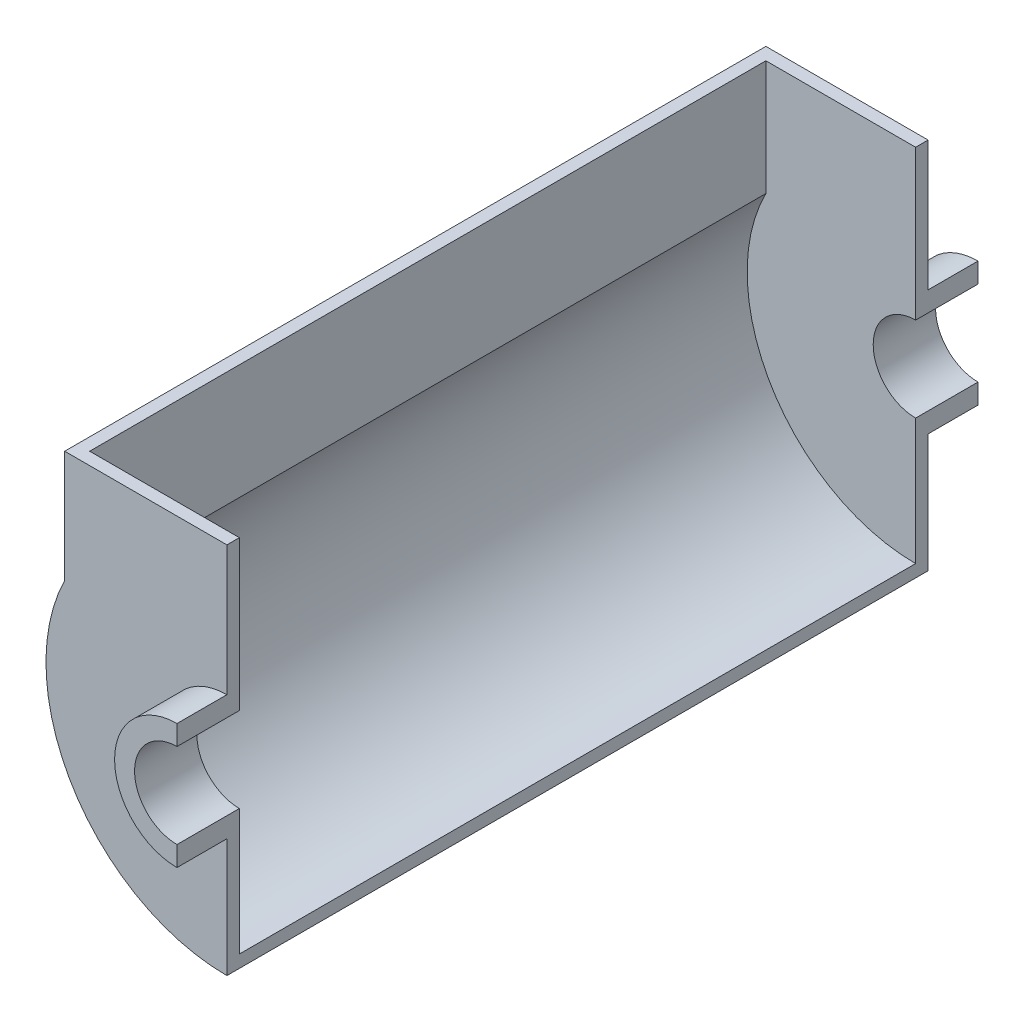
ISO-10303-21;
HEADER;
FILE_DESCRIPTION(('STEP AP214'),'2;1');
FILE_NAME('part.step','',(''),(''),'','','');
FILE_SCHEMA(('AUTOMOTIVE_DESIGN { 1 0 10303 214 1 1 1 1 }'));
ENDSEC;
DATA;
#1=APPLICATION_CONTEXT('core data for automotive mechanical design processes');
#2=APPLICATION_PROTOCOL_DEFINITION('international standard','automotive_design',2000,#1);
#3=PRODUCT_CONTEXT('',#1,'mechanical');
#4=PRODUCT('Part','Part','',(#3));
#5=PRODUCT_RELATED_PRODUCT_CATEGORY('part','',(#4));
#6=PRODUCT_DEFINITION_FORMATION('','',#4);
#7=PRODUCT_DEFINITION_CONTEXT('part definition',#1,'design');
#8=PRODUCT_DEFINITION('design','',#6,#7);
#9=PRODUCT_DEFINITION_SHAPE('','',#8);
#10=(LENGTH_UNIT() NAMED_UNIT(*) SI_UNIT(.MILLI.,.METRE.));
#11=(NAMED_UNIT(*) PLANE_ANGLE_UNIT() SI_UNIT($,.RADIAN.));
#12=(NAMED_UNIT(*) SI_UNIT($,.STERADIAN.) SOLID_ANGLE_UNIT());
#13=UNCERTAINTY_MEASURE_WITH_UNIT(LENGTH_MEASURE(1.E-05),#10,'distance_accuracy_value','');
#14=(GEOMETRIC_REPRESENTATION_CONTEXT(3) GLOBAL_UNCERTAINTY_ASSIGNED_CONTEXT((#13)) GLOBAL_UNIT_ASSIGNED_CONTEXT((#10,
#11,#12)) REPRESENTATION_CONTEXT('',''));
#15=CARTESIAN_POINT('',(0.,0.,0.));
#16=DIRECTION('',(0.,0.,1.));
#17=DIRECTION('',(1.,0.,0.));
#18=AXIS2_PLACEMENT_3D('',#15,#16,#17);
#19=CARTESIAN_POINT('',(0.,0.,-5.));
#20=DIRECTION('',(0.,0.,1.));
#21=DIRECTION('',(1.,0.,0.));
#22=AXIS2_PLACEMENT_3D('',#19,#20,#21);
#23=PLANE('',#22);
#24=CARTESIAN_POINT('',(0.,0.,-5.));
#25=DIRECTION('',(0.,0.,1.));
#26=DIRECTION('',(-1.,0.,0.));
#27=AXIS2_PLACEMENT_3D('',#24,#25,#26);
#28=CIRCLE('',#27,67.5);
#29=CARTESIAN_POINT('',(-60.,30.9232921921324,-5.));
#30=VERTEX_POINT('',#29);
#31=CARTESIAN_POINT('',(0.,-67.5,-5.));
#32=VERTEX_POINT('',#31);
#33=EDGE_CURVE('E193',#30,#32,#28,.T.);
#34=ORIENTED_EDGE('',*,*,#33,.F.);
#35=DIRECTION('',(0.,-1.,0.));
#36=VECTOR('',#35,1.);
#37=CARTESIAN_POINT('',(-60.,77.,-5.));
#38=LINE('',#37,#36);
#39=CARTESIAN_POINT('',(-60.,77.,-5.));
#40=VERTEX_POINT('',#39);
#41=EDGE_CURVE('E50',#40,#30,#38,.T.);
#42=ORIENTED_EDGE('',*,*,#41,.F.);
#43=DIRECTION('',(-1.,0.,0.));
#44=VECTOR('',#43,1.);
#45=CARTESIAN_POINT('',(0.,77.,-5.));
#46=LINE('',#45,#44);
#47=CARTESIAN_POINT('',(0.,77.,-5.));
#48=VERTEX_POINT('',#47);
#49=EDGE_CURVE('E209',#48,#40,#46,.T.);
#50=ORIENTED_EDGE('',*,*,#49,.F.);
#51=DIRECTION('',(0.,1.,0.));
#52=VECTOR('',#51,1.);
#53=CARTESIAN_POINT('',(0.,25.,-5.));
#54=LINE('',#53,#52);
#55=CARTESIAN_POINT('',(0.,17.,-5.));
#56=VERTEX_POINT('',#55);
#57=EDGE_CURVE('E251',#56,#48,#54,.T.);
#58=ORIENTED_EDGE('',*,*,#57,.F.);
#59=CARTESIAN_POINT('',(0.,0.,-5.));
#60=DIRECTION('',(0.,0.,-1.));
#61=DIRECTION('',(1.,0.,0.));
#62=AXIS2_PLACEMENT_3D('',#59,#60,#61);
#63=CIRCLE('',#62,17.);
#64=CARTESIAN_POINT('',(0.,-17.,-5.));
#65=VERTEX_POINT('',#64);
#66=EDGE_CURVE('E248',#65,#56,#63,.T.);
#67=ORIENTED_EDGE('',*,*,#66,.F.);
#68=DIRECTION('',(0.,1.,0.));
#69=VECTOR('',#68,1.);
#70=CARTESIAN_POINT('',(0.,-17.,-5.));
#71=LINE('',#70,#69);
#72=EDGE_CURVE('E56',#32,#65,#71,.T.);
#73=ORIENTED_EDGE('',*,*,#72,.F.);
#74=EDGE_LOOP('',(#34,#42,#50,#58,#67,#73));
#75=FACE_BOUND('',#74,.T.);
#76=ADVANCED_FACE('F33',(#75),#23,.F.);
#77=CARTESIAN_POINT('',(0.,0.,-5.));
#78=DIRECTION('',(0.,0.,1.));
#79=DIRECTION('',(1.,0.,0.));
#80=AXIS2_PLACEMENT_3D('',#77,#78,#79);
#81=CYLINDRICAL_SURFACE('',#80,17.);
#82=DIRECTION('',(0.,0.,1.));
#83=VECTOR('',#82,1.);
#84=CARTESIAN_POINT('',(0.,17.,-5.));
#85=LINE('',#84,#83);
#86=CARTESIAN_POINT('',(0.,17.,20.));
#87=VERTEX_POINT('',#86);
#88=EDGE_CURVE('E37',#56,#87,#85,.T.);
#89=ORIENTED_EDGE('',*,*,#88,.T.);
#90=CARTESIAN_POINT('',(0.,0.,20.));
#91=DIRECTION('',(0.,0.,-1.));
#92=DIRECTION('',(1.,0.,0.));
#93=AXIS2_PLACEMENT_3D('',#90,#91,#92);
#94=CIRCLE('',#93,17.);
#95=CARTESIAN_POINT('',(0.,-17.,20.));
#96=VERTEX_POINT('',#95);
#97=EDGE_CURVE('E231',#96,#87,#94,.T.);
#98=ORIENTED_EDGE('',*,*,#97,.F.);
#99=DIRECTION('',(0.,0.,1.));
#100=VECTOR('',#99,1.);
#101=CARTESIAN_POINT('',(0.,-17.,-5.));
#102=LINE('',#101,#100);
#103=EDGE_CURVE('E11',#65,#96,#102,.T.);
#104=ORIENTED_EDGE('',*,*,#103,.F.);
#105=ORIENTED_EDGE('',*,*,#66,.T.);
#106=EDGE_LOOP('',(#89,#98,#104,#105));
#107=FACE_BOUND('',#106,.T.);
#108=ADVANCED_FACE('F35',(#107),#81,.F.);
#109=CARTESIAN_POINT('',(0.,-17.,-5.));
#110=DIRECTION('',(1.,0.,0.));
#111=DIRECTION('',(0.,0.,-1.));
#112=AXIS2_PLACEMENT_3D('',#109,#110,#111);
#113=PLANE('',#112);
#114=ORIENTED_EDGE('',*,*,#103,.T.);
#115=DIRECTION('',(0.,1.,0.));
#116=VECTOR('',#115,1.);
#117=CARTESIAN_POINT('',(0.,-17.,20.));
#118=LINE('',#117,#116);
#119=CARTESIAN_POINT('',(0.,-25.,20.));
#120=VERTEX_POINT('',#119);
#121=EDGE_CURVE('E245',#120,#96,#118,.T.);
#122=ORIENTED_EDGE('',*,*,#121,.F.);
#123=DIRECTION('',(0.,0.,1.));
#124=VECTOR('',#123,1.);
#125=CARTESIAN_POINT('',(0.,-25.,-5.));
#126=LINE('',#125,#124);
#127=CARTESIAN_POINT('',(0.,-25.,0.));
#128=VERTEX_POINT('',#127);
#129=EDGE_CURVE('E42',#128,#120,#126,.T.);
#130=ORIENTED_EDGE('',*,*,#129,.F.);
#131=DIRECTION('',(0.,1.,0.));
#132=VECTOR('',#131,1.);
#133=CARTESIAN_POINT('',(0.,-25.,0.));
#134=LINE('',#133,#132);
#135=CARTESIAN_POINT('',(0.,-72.5,0.));
#136=VERTEX_POINT('',#135);
#137=EDGE_CURVE('E212',#136,#128,#134,.T.);
#138=ORIENTED_EDGE('',*,*,#137,.F.);
#139=DIRECTION('',(0.,0.,1.));
#140=VECTOR('',#139,1.);
#141=CARTESIAN_POINT('',(0.,-72.5,-5.));
#142=LINE('',#141,#140);
#143=CARTESIAN_POINT('',(0.,-72.5,-281.));
#144=VERTEX_POINT('',#143);
#145=EDGE_CURVE('E229',#144,#136,#142,.T.);
#146=ORIENTED_EDGE('',*,*,#145,.F.);
#147=DIRECTION('',(0.,1.,0.));
#148=VECTOR('',#147,1.);
#149=CARTESIAN_POINT('',(0.,-25.,-281.));
#150=LINE('',#149,#148);
#151=CARTESIAN_POINT('',(0.,-25.,-281.));
#152=VERTEX_POINT('',#151);
#153=EDGE_CURVE('E160',#144,#152,#150,.T.);
#154=ORIENTED_EDGE('',*,*,#153,.T.);
#155=DIRECTION('',(0.,0.,-1.));
#156=VECTOR('',#155,1.);
#157=CARTESIAN_POINT('',(0.,-25.,-276.));
#158=LINE('',#157,#156);
#159=CARTESIAN_POINT('',(0.,-25.,-301.));
#160=VERTEX_POINT('',#159);
#161=EDGE_CURVE('E186',#152,#160,#158,.T.);
#162=ORIENTED_EDGE('',*,*,#161,.T.);
#163=DIRECTION('',(0.,1.,0.));
#164=VECTOR('',#163,1.);
#165=CARTESIAN_POINT('',(0.,-17.,-301.));
#166=LINE('',#165,#164);
#167=CARTESIAN_POINT('',(0.,-17.,-301.));
#168=VERTEX_POINT('',#167);
#169=EDGE_CURVE('E179',#160,#168,#166,.T.);
#170=ORIENTED_EDGE('',*,*,#169,.T.);
#171=DIRECTION('',(0.,0.,-1.));
#172=VECTOR('',#171,1.);
#173=CARTESIAN_POINT('',(0.,-17.,-276.));
#174=LINE('',#173,#172);
#175=CARTESIAN_POINT('',(0.,-17.,-276.));
#176=VERTEX_POINT('',#175);
#177=EDGE_CURVE('E183',#176,#168,#174,.T.);
#178=ORIENTED_EDGE('',*,*,#177,.F.);
#179=DIRECTION('',(0.,1.,0.));
#180=VECTOR('',#179,1.);
#181=CARTESIAN_POINT('',(0.,-17.,-276.));
#182=LINE('',#181,#180);
#183=CARTESIAN_POINT('',(0.,-67.5,-276.));
#184=VERTEX_POINT('',#183);
#185=EDGE_CURVE('E175',#184,#176,#182,.T.);
#186=ORIENTED_EDGE('',*,*,#185,.F.);
#187=DIRECTION('',(0.,0.,1.));
#188=VECTOR('',#187,1.);
#189=CARTESIAN_POINT('',(0.,-67.5,-442.152038807834));
#190=LINE('',#189,#188);
#191=EDGE_CURVE('E196',#184,#32,#190,.T.);
#192=ORIENTED_EDGE('',*,*,#191,.T.);
#193=ORIENTED_EDGE('',*,*,#72,.T.);
#194=EDGE_LOOP('',(#114,#122,#130,#138,#146,#154,#162,#170,#178,#186,#192,#193));
#195=FACE_BOUND('',#194,.T.);
#196=ADVANCED_FACE('F269',(#195),#113,.T.);
#197=CARTESIAN_POINT('',(0.,0.,-5.));
#198=DIRECTION('',(0.,0.,1.));
#199=DIRECTION('',(1.,0.,0.));
#200=AXIS2_PLACEMENT_3D('',#197,#198,#199);
#201=CYLINDRICAL_SURFACE('',#200,25.);
#202=CARTESIAN_POINT('',(0.,0.,0.));
#203=DIRECTION('',(0.,0.,-1.));
#204=DIRECTION('',(1.,0.,0.));
#205=AXIS2_PLACEMENT_3D('',#202,#203,#204);
#206=CIRCLE('',#205,25.);
#207=CARTESIAN_POINT('',(0.,25.,0.));
#208=VERTEX_POINT('',#207);
#209=EDGE_CURVE('E202',#128,#208,#206,.T.);
#210=ORIENTED_EDGE('',*,*,#209,.F.);
#211=ORIENTED_EDGE('',*,*,#129,.T.);
#212=CARTESIAN_POINT('',(0.,0.,20.));
#213=DIRECTION('',(0.,0.,1.));
#214=DIRECTION('',(1.,0.,0.));
#215=AXIS2_PLACEMENT_3D('',#212,#213,#214);
#216=CIRCLE('',#215,25.);
#217=CARTESIAN_POINT('',(0.,25.,20.));
#218=VERTEX_POINT('',#217);
#219=EDGE_CURVE('E242',#218,#120,#216,.T.);
#220=ORIENTED_EDGE('',*,*,#219,.F.);
#221=DIRECTION('',(0.,0.,1.));
#222=VECTOR('',#221,1.);
#223=CARTESIAN_POINT('',(0.,25.,-5.));
#224=LINE('',#223,#222);
#225=EDGE_CURVE('E254',#208,#218,#224,.T.);
#226=ORIENTED_EDGE('',*,*,#225,.F.);
#227=EDGE_LOOP('',(#210,#211,#220,#226));
#228=FACE_BOUND('',#227,.T.);
#229=ADVANCED_FACE('F276',(#228),#201,.T.);
#230=CARTESIAN_POINT('',(0.,25.,-5.));
#231=DIRECTION('',(1.,0.,0.));
#232=DIRECTION('',(0.,0.,-1.));
#233=AXIS2_PLACEMENT_3D('',#230,#231,#232);
#234=PLANE('',#233);
#235=ORIENTED_EDGE('',*,*,#57,.T.);
#236=DIRECTION('',(0.,0.,1.));
#237=VECTOR('',#236,1.);
#238=CARTESIAN_POINT('',(0.,77.,-5.));
#239=LINE('',#238,#237);
#240=CARTESIAN_POINT('',(0.,77.,0.));
#241=VERTEX_POINT('',#240);
#242=EDGE_CURVE('E211',#48,#241,#239,.T.);
#243=ORIENTED_EDGE('',*,*,#242,.T.);
#244=DIRECTION('',(0.,1.,0.));
#245=VECTOR('',#244,1.);
#246=CARTESIAN_POINT('',(0.,25.,0.));
#247=LINE('',#246,#245);
#248=EDGE_CURVE('E215',#208,#241,#247,.T.);
#249=ORIENTED_EDGE('',*,*,#248,.F.);
#250=ORIENTED_EDGE('',*,*,#225,.T.);
#251=DIRECTION('',(0.,1.,0.));
#252=VECTOR('',#251,1.);
#253=CARTESIAN_POINT('',(0.,25.,20.));
#254=LINE('',#253,#252);
#255=EDGE_CURVE('E239',#87,#218,#254,.T.);
#256=ORIENTED_EDGE('',*,*,#255,.F.);
#257=ORIENTED_EDGE('',*,*,#88,.F.);
#258=EDGE_LOOP('',(#235,#243,#249,#250,#256,#257));
#259=FACE_BOUND('',#258,.T.);
#260=ADVANCED_FACE('F262',(#259),#234,.T.);
#261=CARTESIAN_POINT('',(0.,0.,20.));
#262=DIRECTION('',(0.,0.,1.));
#263=DIRECTION('',(1.,0.,0.));
#264=AXIS2_PLACEMENT_3D('',#261,#262,#263);
#265=PLANE('',#264);
#266=ORIENTED_EDGE('',*,*,#97,.T.);
#267=ORIENTED_EDGE('',*,*,#255,.T.);
#268=ORIENTED_EDGE('',*,*,#219,.T.);
#269=ORIENTED_EDGE('',*,*,#121,.T.);
#270=EDGE_LOOP('',(#266,#267,#268,#269));
#271=FACE_BOUND('',#270,.T.);
#272=ADVANCED_FACE('F265',(#271),#265,.T.);
#273=CARTESIAN_POINT('',(0.,0.,-5.));
#274=DIRECTION('',(0.,0.,1.));
#275=DIRECTION('',(1.,0.,0.));
#276=AXIS2_PLACEMENT_3D('',#273,#274,#275);
#277=CYLINDRICAL_SURFACE('',#276,72.5);
#278=CARTESIAN_POINT('',(0.,0.,0.));
#279=DIRECTION('',(0.,0.,1.));
#280=DIRECTION('',(1.,0.,0.));
#281=AXIS2_PLACEMENT_3D('',#278,#279,#280);
#282=CIRCLE('',#281,72.5);
#283=CARTESIAN_POINT('',(-65.,32.1130814466628,0.));
#284=VERTEX_POINT('',#283);
#285=EDGE_CURVE('E224',#284,#136,#282,.T.);
#286=ORIENTED_EDGE('',*,*,#285,.F.);
#287=DIRECTION('',(0.,0.,1.));
#288=VECTOR('',#287,1.);
#289=CARTESIAN_POINT('',(-65.,32.1130814466628,-5.));
#290=LINE('',#289,#288);
#291=CARTESIAN_POINT('',(-65.,32.1130814466628,-281.));
#292=VERTEX_POINT('',#291);
#293=EDGE_CURVE('E232',#292,#284,#290,.T.);
#294=ORIENTED_EDGE('',*,*,#293,.F.);
#295=CARTESIAN_POINT('',(0.,0.,-281.));
#296=DIRECTION('',(0.,0.,1.));
#297=DIRECTION('',(1.,0.,0.));
#298=AXIS2_PLACEMENT_3D('',#295,#296,#297);
#299=CIRCLE('',#298,72.5);
#300=EDGE_CURVE('E344',#292,#144,#299,.T.);
#301=ORIENTED_EDGE('',*,*,#300,.T.);
#302=ORIENTED_EDGE('',*,*,#145,.T.);
#303=EDGE_LOOP('',(#286,#294,#301,#302));
#304=FACE_BOUND('',#303,.T.);
#305=ADVANCED_FACE('F292',(#304),#277,.T.);
#306=CARTESIAN_POINT('',(-65.,77.,-5.));
#307=DIRECTION('',(-1.,0.,0.));
#308=DIRECTION('',(0.,0.,1.));
#309=AXIS2_PLACEMENT_3D('',#306,#307,#308);
#310=PLANE('',#309);
#311=DIRECTION('',(0.,-1.,0.));
#312=VECTOR('',#311,1.);
#313=CARTESIAN_POINT('',(-65.,77.,0.));
#314=LINE('',#313,#312);
#315=CARTESIAN_POINT('',(-65.,77.,0.));
#316=VERTEX_POINT('',#315);
#317=EDGE_CURVE('E221',#316,#284,#314,.T.);
#318=ORIENTED_EDGE('',*,*,#317,.F.);
#319=DIRECTION('',(0.,0.,1.));
#320=VECTOR('',#319,1.);
#321=CARTESIAN_POINT('',(-65.,77.,-5.));
#322=LINE('',#321,#320);
#323=CARTESIAN_POINT('',(-65.,77.,-281.));
#324=VERTEX_POINT('',#323);
#325=EDGE_CURVE('E234',#324,#316,#322,.T.);
#326=ORIENTED_EDGE('',*,*,#325,.F.);
#327=DIRECTION('',(0.,-1.,0.));
#328=VECTOR('',#327,1.);
#329=CARTESIAN_POINT('',(-65.,77.,-281.));
#330=LINE('',#329,#328);
#331=EDGE_CURVE('E346',#324,#292,#330,.T.);
#332=ORIENTED_EDGE('',*,*,#331,.T.);
#333=ORIENTED_EDGE('',*,*,#293,.T.);
#334=EDGE_LOOP('',(#318,#326,#332,#333));
#335=FACE_BOUND('',#334,.T.);
#336=ADVANCED_FACE('F295',(#335),#310,.T.);
#337=CARTESIAN_POINT('',(0.,77.,-5.));
#338=DIRECTION('',(0.,1.,0.));
#339=DIRECTION('',(-1.,0.,0.));
#340=AXIS2_PLACEMENT_3D('',#337,#338,#339);
#341=PLANE('',#340);
#342=DIRECTION('',(-1.,0.,0.));
#343=VECTOR('',#342,1.);
#344=CARTESIAN_POINT('',(0.,77.,0.));
#345=LINE('',#344,#343);
#346=EDGE_CURVE('E218',#241,#316,#345,.T.);
#347=ORIENTED_EDGE('',*,*,#346,.F.);
#348=ORIENTED_EDGE('',*,*,#242,.F.);
#349=ORIENTED_EDGE('',*,*,#49,.T.);
#350=DIRECTION('',(0.,0.,1.));
#351=VECTOR('',#350,1.);
#352=CARTESIAN_POINT('',(-60.,77.,-442.152038807834));
#353=LINE('',#352,#351);
#354=CARTESIAN_POINT('',(-60.,77.,-276.));
#355=VERTEX_POINT('',#354);
#356=EDGE_CURVE('E156',#355,#40,#353,.T.);
#357=ORIENTED_EDGE('',*,*,#356,.F.);
#358=DIRECTION('',(-1.,0.,0.));
#359=VECTOR('',#358,1.);
#360=CARTESIAN_POINT('',(0.,77.,-276.));
#361=LINE('',#360,#359);
#362=CARTESIAN_POINT('',(0.,77.,-276.));
#363=VERTEX_POINT('',#362);
#364=EDGE_CURVE('E148',#363,#355,#361,.T.);
#365=ORIENTED_EDGE('',*,*,#364,.F.);
#366=DIRECTION('',(0.,0.,-1.));
#367=VECTOR('',#366,1.);
#368=CARTESIAN_POINT('',(0.,77.,-276.));
#369=LINE('',#368,#367);
#370=CARTESIAN_POINT('',(0.,77.,-281.));
#371=VERTEX_POINT('',#370);
#372=EDGE_CURVE('E153',#363,#371,#369,.T.);
#373=ORIENTED_EDGE('',*,*,#372,.T.);
#374=DIRECTION('',(-1.,0.,0.));
#375=VECTOR('',#374,1.);
#376=CARTESIAN_POINT('',(0.,77.,-281.));
#377=LINE('',#376,#375);
#378=EDGE_CURVE('E360',#371,#324,#377,.T.);
#379=ORIENTED_EDGE('',*,*,#378,.T.);
#380=ORIENTED_EDGE('',*,*,#325,.T.);
#381=EDGE_LOOP('',(#347,#348,#349,#357,#365,#373,#379,#380));
#382=FACE_BOUND('',#381,.T.);
#383=ADVANCED_FACE('F151',(#382),#341,.T.);
#384=CARTESIAN_POINT('',(0.,0.,0.));
#385=DIRECTION('',(0.,0.,1.));
#386=DIRECTION('',(1.,0.,0.));
#387=AXIS2_PLACEMENT_3D('',#384,#385,#386);
#388=PLANE('',#387);
#389=ORIENTED_EDGE('',*,*,#209,.T.);
#390=ORIENTED_EDGE('',*,*,#248,.T.);
#391=ORIENTED_EDGE('',*,*,#346,.T.);
#392=ORIENTED_EDGE('',*,*,#317,.T.);
#393=ORIENTED_EDGE('',*,*,#285,.T.);
#394=ORIENTED_EDGE('',*,*,#137,.T.);
#395=EDGE_LOOP('',(#389,#390,#391,#392,#393,#394));
#396=FACE_BOUND('',#395,.T.);
#397=ADVANCED_FACE('F274',(#396),#388,.T.);
#398=CARTESIAN_POINT('',(-60.,77.,-442.152038807834));
#399=DIRECTION('',(-1.,0.,0.));
#400=DIRECTION('',(0.,0.,1.));
#401=AXIS2_PLACEMENT_3D('',#398,#399,#400);
#402=PLANE('',#401);
#403=DIRECTION('',(0.,-1.,0.));
#404=VECTOR('',#403,1.);
#405=CARTESIAN_POINT('',(-60.,77.,-276.));
#406=LINE('',#405,#404);
#407=CARTESIAN_POINT('',(-60.,30.9232921921324,-276.));
#408=VERTEX_POINT('',#407);
#409=EDGE_CURVE('E203',#355,#408,#406,.T.);
#410=ORIENTED_EDGE('',*,*,#409,.F.);
#411=ORIENTED_EDGE('',*,*,#356,.T.);
#412=ORIENTED_EDGE('',*,*,#41,.T.);
#413=DIRECTION('',(0.,0.,1.));
#414=VECTOR('',#413,1.);
#415=CARTESIAN_POINT('',(-60.,30.9232921921324,-442.152038807834));
#416=LINE('',#415,#414);
#417=EDGE_CURVE('E197',#408,#30,#416,.T.);
#418=ORIENTED_EDGE('',*,*,#417,.F.);
#419=EDGE_LOOP('',(#410,#411,#412,#418));
#420=FACE_BOUND('',#419,.T.);
#421=ADVANCED_FACE('F304',(#420),#402,.F.);
#422=CARTESIAN_POINT('',(0.,0.,-442.152038807834));
#423=DIRECTION('',(0.,0.,1.));
#424=DIRECTION('',(1.,0.,0.));
#425=AXIS2_PLACEMENT_3D('',#422,#423,#424);
#426=CYLINDRICAL_SURFACE('',#425,67.5);
#427=CARTESIAN_POINT('',(0.,0.,-276.));
#428=DIRECTION('',(0.,0.,-1.));
#429=DIRECTION('',(-1.,0.,0.));
#430=AXIS2_PLACEMENT_3D('',#427,#428,#429);
#431=CIRCLE('',#430,67.5);
#432=EDGE_CURVE('E199',#408,#184,#431,.F.);
#433=ORIENTED_EDGE('',*,*,#432,.F.);
#434=ORIENTED_EDGE('',*,*,#417,.T.);
#435=ORIENTED_EDGE('',*,*,#33,.T.);
#436=ORIENTED_EDGE('',*,*,#191,.F.);
#437=EDGE_LOOP('',(#433,#434,#435,#436));
#438=FACE_BOUND('',#437,.T.);
#439=ADVANCED_FACE('F307',(#438),#426,.F.);
#440=CARTESIAN_POINT('',(0.,0.,-276.));
#441=DIRECTION('',(0.,0.,-1.));
#442=DIRECTION('',(1.,0.,0.));
#443=AXIS2_PLACEMENT_3D('',#440,#441,#442);
#444=PLANE('',#443);
#445=ORIENTED_EDGE('',*,*,#364,.T.);
#446=ORIENTED_EDGE('',*,*,#409,.T.);
#447=ORIENTED_EDGE('',*,*,#432,.T.);
#448=ORIENTED_EDGE('',*,*,#185,.T.);
#449=CARTESIAN_POINT('',(0.,0.,-276.));
#450=DIRECTION('',(0.,0.,-1.));
#451=DIRECTION('',(1.,0.,0.));
#452=AXIS2_PLACEMENT_3D('',#449,#450,#451);
#453=CIRCLE('',#452,17.);
#454=CARTESIAN_POINT('',(0.,17.,-276.));
#455=VERTEX_POINT('',#454);
#456=EDGE_CURVE('E173',#176,#455,#453,.T.);
#457=ORIENTED_EDGE('',*,*,#456,.T.);
#458=DIRECTION('',(0.,1.,0.));
#459=VECTOR('',#458,1.);
#460=CARTESIAN_POINT('',(0.,25.,-276.));
#461=LINE('',#460,#459);
#462=EDGE_CURVE('E165',#455,#363,#461,.T.);
#463=ORIENTED_EDGE('',*,*,#462,.T.);
#464=EDGE_LOOP('',(#445,#446,#447,#448,#457,#463));
#465=FACE_BOUND('',#464,.T.);
#466=ADVANCED_FACE('F171',(#465),#444,.F.);
#467=CARTESIAN_POINT('',(0.,0.,-276.));
#468=DIRECTION('',(0.,0.,-1.));
#469=DIRECTION('',(1.,0.,0.));
#470=AXIS2_PLACEMENT_3D('',#467,#468,#469);
#471=CYLINDRICAL_SURFACE('',#470,17.);
#472=DIRECTION('',(0.,0.,-1.));
#473=VECTOR('',#472,1.);
#474=CARTESIAN_POINT('',(0.,17.,-276.));
#475=LINE('',#474,#473);
#476=CARTESIAN_POINT('',(0.,17.,-301.));
#477=VERTEX_POINT('',#476);
#478=EDGE_CURVE('E177',#455,#477,#475,.T.);
#479=ORIENTED_EDGE('',*,*,#478,.F.);
#480=ORIENTED_EDGE('',*,*,#456,.F.);
#481=ORIENTED_EDGE('',*,*,#177,.T.);
#482=CARTESIAN_POINT('',(0.,0.,-301.));
#483=DIRECTION('',(0.,0.,-1.));
#484=DIRECTION('',(1.,0.,0.));
#485=AXIS2_PLACEMENT_3D('',#482,#483,#484);
#486=CIRCLE('',#485,17.);
#487=EDGE_CURVE('E169',#168,#477,#486,.T.);
#488=ORIENTED_EDGE('',*,*,#487,.T.);
#489=EDGE_LOOP('',(#479,#480,#481,#488));
#490=FACE_BOUND('',#489,.T.);
#491=ADVANCED_FACE('F312',(#490),#471,.F.);
#492=CARTESIAN_POINT('',(0.,0.,-276.));
#493=DIRECTION('',(0.,0.,-1.));
#494=DIRECTION('',(1.,0.,0.));
#495=AXIS2_PLACEMENT_3D('',#492,#493,#494);
#496=CYLINDRICAL_SURFACE('',#495,25.);
#497=CARTESIAN_POINT('',(0.,0.,-281.));
#498=DIRECTION('',(0.,0.,-1.));
#499=DIRECTION('',(1.,0.,0.));
#500=AXIS2_PLACEMENT_3D('',#497,#498,#499);
#501=CIRCLE('',#500,25.);
#502=CARTESIAN_POINT('',(0.,25.,-281.));
#503=VERTEX_POINT('',#502);
#504=EDGE_CURVE('E335',#152,#503,#501,.T.);
#505=ORIENTED_EDGE('',*,*,#504,.T.);
#506=DIRECTION('',(0.,0.,-1.));
#507=VECTOR('',#506,1.);
#508=CARTESIAN_POINT('',(0.,25.,-276.));
#509=LINE('',#508,#507);
#510=CARTESIAN_POINT('',(0.,25.,-301.));
#511=VERTEX_POINT('',#510);
#512=EDGE_CURVE('E189',#503,#511,#509,.T.);
#513=ORIENTED_EDGE('',*,*,#512,.T.);
#514=CARTESIAN_POINT('',(0.,0.,-301.));
#515=DIRECTION('',(0.,0.,1.));
#516=DIRECTION('',(1.,0.,0.));
#517=AXIS2_PLACEMENT_3D('',#514,#515,#516);
#518=CIRCLE('',#517,25.);
#519=EDGE_CURVE('E341',#511,#160,#518,.T.);
#520=ORIENTED_EDGE('',*,*,#519,.T.);
#521=ORIENTED_EDGE('',*,*,#161,.F.);
#522=EDGE_LOOP('',(#505,#513,#520,#521));
#523=FACE_BOUND('',#522,.T.);
#524=ADVANCED_FACE('F315',(#523),#496,.T.);
#525=CARTESIAN_POINT('',(0.,25.,-276.));
#526=DIRECTION('',(1.,0.,0.));
#527=DIRECTION('',(0.,0.,1.));
#528=AXIS2_PLACEMENT_3D('',#525,#526,#527);
#529=PLANE('',#528);
#530=ORIENTED_EDGE('',*,*,#462,.F.);
#531=ORIENTED_EDGE('',*,*,#478,.T.);
#532=DIRECTION('',(0.,1.,0.));
#533=VECTOR('',#532,1.);
#534=CARTESIAN_POINT('',(0.,25.,-301.));
#535=LINE('',#534,#533);
#536=EDGE_CURVE('E352',#477,#511,#535,.T.);
#537=ORIENTED_EDGE('',*,*,#536,.T.);
#538=ORIENTED_EDGE('',*,*,#512,.F.);
#539=DIRECTION('',(0.,1.,0.));
#540=VECTOR('',#539,1.);
#541=CARTESIAN_POINT('',(0.,25.,-281.));
#542=LINE('',#541,#540);
#543=EDGE_CURVE('E168',#503,#371,#542,.T.);
#544=ORIENTED_EDGE('',*,*,#543,.T.);
#545=ORIENTED_EDGE('',*,*,#372,.F.);
#546=EDGE_LOOP('',(#530,#531,#537,#538,#544,#545));
#547=FACE_BOUND('',#546,.T.);
#548=ADVANCED_FACE('F163',(#547),#529,.T.);
#549=CARTESIAN_POINT('',(0.,0.,-301.));
#550=DIRECTION('',(0.,0.,-1.));
#551=DIRECTION('',(1.,0.,0.));
#552=AXIS2_PLACEMENT_3D('',#549,#550,#551);
#553=PLANE('',#552);
#554=ORIENTED_EDGE('',*,*,#487,.F.);
#555=ORIENTED_EDGE('',*,*,#169,.F.);
#556=ORIENTED_EDGE('',*,*,#519,.F.);
#557=ORIENTED_EDGE('',*,*,#536,.F.);
#558=EDGE_LOOP('',(#554,#555,#556,#557));
#559=FACE_BOUND('',#558,.T.);
#560=ADVANCED_FACE('F319',(#559),#553,.T.);
#561=CARTESIAN_POINT('',(0.,0.,-281.));
#562=DIRECTION('',(0.,0.,-1.));
#563=DIRECTION('',(1.,0.,0.));
#564=AXIS2_PLACEMENT_3D('',#561,#562,#563);
#565=PLANE('',#564);
#566=ORIENTED_EDGE('',*,*,#504,.F.);
#567=ORIENTED_EDGE('',*,*,#153,.F.);
#568=ORIENTED_EDGE('',*,*,#300,.F.);
#569=ORIENTED_EDGE('',*,*,#331,.F.);
#570=ORIENTED_EDGE('',*,*,#378,.F.);
#571=ORIENTED_EDGE('',*,*,#543,.F.);
#572=EDGE_LOOP('',(#566,#567,#568,#569,#570,#571));
#573=FACE_BOUND('',#572,.T.);
#574=ADVANCED_FACE('F327',(#573),#565,.T.);
#575=CLOSED_SHELL('',(#76,#108,#196,#229,#260,#272,#305,#336,#383,#397,#421,#439,#466,#491,#524,
#548,#560,#574));
#576=MANIFOLD_SOLID_BREP('B2',#575);
#577=ADVANCED_BREP_SHAPE_REPRESENTATION('',(#18,#576),#14);
#578=SHAPE_DEFINITION_REPRESENTATION(#9,#577);
ENDSEC;
END-ISO-10303-21;
